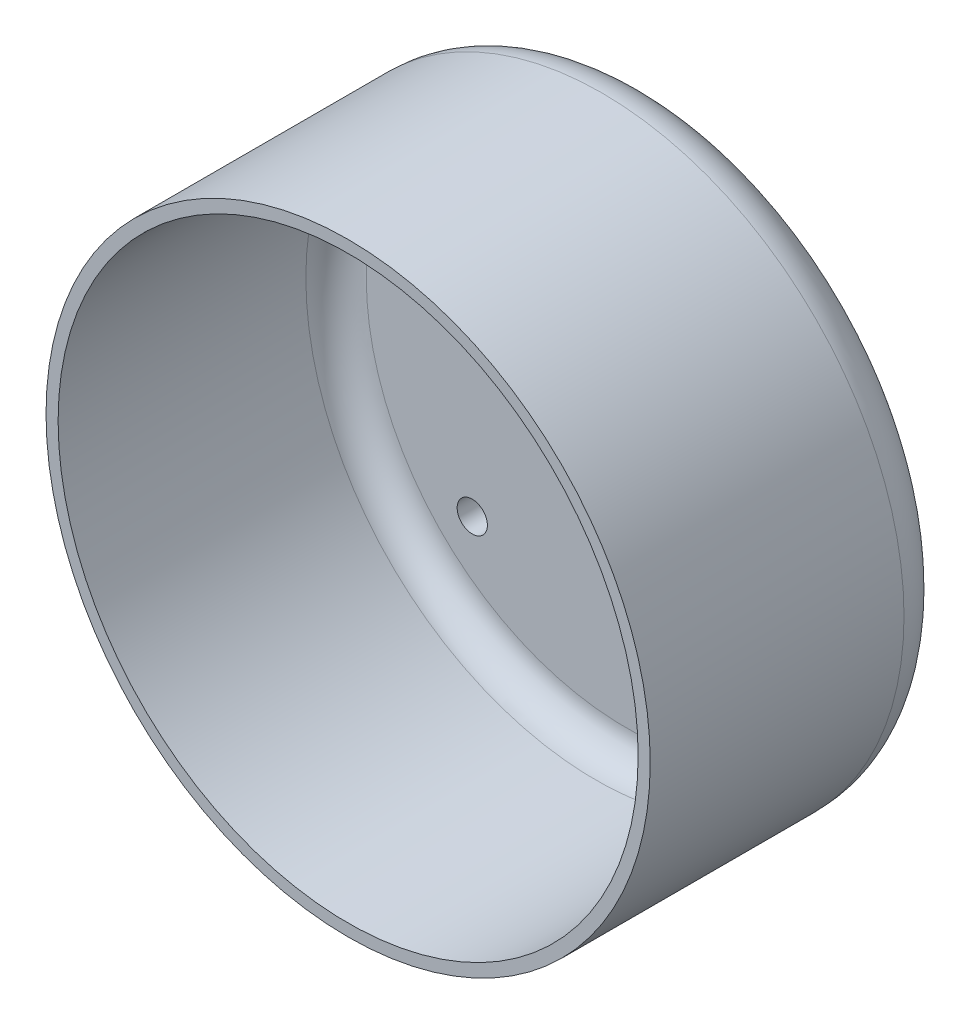
ISO-10303-21;
HEADER;
FILE_DESCRIPTION(('STEP AP214'),'2;1');
FILE_NAME('part.step','',(''),(''),'','','');
FILE_SCHEMA(('AUTOMOTIVE_DESIGN { 1 0 10303 214 1 1 1 1 }'));
ENDSEC;
DATA;
#1=APPLICATION_CONTEXT('core data for automotive mechanical design processes');
#2=APPLICATION_PROTOCOL_DEFINITION('international standard','automotive_design',2000,#1);
#3=PRODUCT_CONTEXT('',#1,'mechanical');
#4=PRODUCT('Part','Part','',(#3));
#5=PRODUCT_RELATED_PRODUCT_CATEGORY('part','',(#4));
#6=PRODUCT_DEFINITION_FORMATION('','',#4);
#7=PRODUCT_DEFINITION_CONTEXT('part definition',#1,'design');
#8=PRODUCT_DEFINITION('design','',#6,#7);
#9=PRODUCT_DEFINITION_SHAPE('','',#8);
#10=(LENGTH_UNIT() NAMED_UNIT(*) SI_UNIT(.MILLI.,.METRE.));
#11=(NAMED_UNIT(*) PLANE_ANGLE_UNIT() SI_UNIT($,.RADIAN.));
#12=(NAMED_UNIT(*) SI_UNIT($,.STERADIAN.) SOLID_ANGLE_UNIT());
#13=UNCERTAINTY_MEASURE_WITH_UNIT(LENGTH_MEASURE(1.E-05),#10,'distance_accuracy_value','');
#14=(GEOMETRIC_REPRESENTATION_CONTEXT(3) GLOBAL_UNCERTAINTY_ASSIGNED_CONTEXT((#13)) GLOBAL_UNIT_ASSIGNED_CONTEXT((#10,
#11,#12)) REPRESENTATION_CONTEXT('',''));
#15=CARTESIAN_POINT('',(0.,0.,0.));
#16=DIRECTION('',(0.,0.,1.));
#17=DIRECTION('',(1.,0.,0.));
#18=AXIS2_PLACEMENT_3D('',#15,#16,#17);
#19=CARTESIAN_POINT('',(0.,0.,0.));
#20=DIRECTION('',(0.,0.,1.));
#21=DIRECTION('',(1.,0.,0.));
#22=AXIS2_PLACEMENT_3D('',#19,#20,#21);
#23=PLANE('',#22);
#24=CARTESIAN_POINT('',(0.,0.,0.));
#25=DIRECTION('',(0.,0.,1.));
#26=DIRECTION('',(1.,0.,0.));
#27=AXIS2_PLACEMENT_3D('',#24,#25,#26);
#28=CIRCLE('',#27,21.);
#29=CARTESIAN_POINT('',(21.,0.,0.));
#30=VERTEX_POINT('',#29);
#31=EDGE_CURVE('E42',#30,#30,#28,.F.);
#32=ORIENTED_EDGE('',*,*,#31,.T.);
#33=EDGE_LOOP('',(#32));
#34=FACE_BOUND('',#33,.T.);
#35=CARTESIAN_POINT('',(-12.727922061358,-12.7279220613577,0.));
#36=DIRECTION('',(0.,0.,-1.));
#37=DIRECTION('',(-1.,0.,0.));
#38=AXIS2_PLACEMENT_3D('',#35,#36,#37);
#39=CIRCLE('',#38,1.24999999999999);
#40=CARTESIAN_POINT('',(-13.977922061358,-12.7279220613577,0.));
#41=VERTEX_POINT('',#40);
#42=EDGE_CURVE('E56',#41,#41,#39,.T.);
#43=ORIENTED_EDGE('',*,*,#42,.F.);
#44=EDGE_LOOP('',(#43));
#45=FACE_BOUND('',#44,.T.);
#46=CARTESIAN_POINT('',(12.7279220613578,-12.7279220613579,0.));
#47=DIRECTION('',(0.,0.,-1.));
#48=DIRECTION('',(-1.,0.,0.));
#49=AXIS2_PLACEMENT_3D('',#46,#47,#48);
#50=CIRCLE('',#49,1.24999999999999);
#51=CARTESIAN_POINT('',(11.4779220613578,-12.7279220613579,0.));
#52=VERTEX_POINT('',#51);
#53=EDGE_CURVE('E55',#52,#52,#50,.T.);
#54=ORIENTED_EDGE('',*,*,#53,.F.);
#55=EDGE_LOOP('',(#54));
#56=FACE_BOUND('',#55,.T.);
#57=CARTESIAN_POINT('',(12.7279220613579,12.7279220613578,0.));
#58=DIRECTION('',(0.,0.,-1.));
#59=DIRECTION('',(-1.,0.,0.));
#60=AXIS2_PLACEMENT_3D('',#57,#58,#59);
#61=CIRCLE('',#60,1.24999999999999);
#62=CARTESIAN_POINT('',(11.4779220613579,12.7279220613578,0.));
#63=VERTEX_POINT('',#62);
#64=EDGE_CURVE('E83',#63,#63,#61,.T.);
#65=ORIENTED_EDGE('',*,*,#64,.F.);
#66=EDGE_LOOP('',(#65));
#67=FACE_BOUND('',#66,.T.);
#68=CARTESIAN_POINT('',(-12.7279220613578,12.7279220613579,0.));
#69=DIRECTION('',(0.,0.,-1.));
#70=DIRECTION('',(-1.,0.,0.));
#71=AXIS2_PLACEMENT_3D('',#68,#69,#70);
#72=CIRCLE('',#71,1.24999999999999);
#73=CARTESIAN_POINT('',(-13.9779220613578,12.7279220613579,0.));
#74=VERTEX_POINT('',#73);
#75=EDGE_CURVE('E77',#74,#74,#72,.T.);
#76=ORIENTED_EDGE('',*,*,#75,.F.);
#77=EDGE_LOOP('',(#76));
#78=FACE_BOUND('',#77,.T.);
#79=CARTESIAN_POINT('',(0.,0.,0.));
#80=DIRECTION('',(0.,0.,1.));
#81=DIRECTION('',(1.,0.,0.));
#82=AXIS2_PLACEMENT_3D('',#79,#80,#81);
#83=CIRCLE('',#82,16.5);
#84=CARTESIAN_POINT('',(16.5,0.,0.));
#85=VERTEX_POINT('',#84);
#86=EDGE_CURVE('E51',#85,#85,#83,.F.);
#87=ORIENTED_EDGE('',*,*,#86,.F.);
#88=EDGE_LOOP('',(#87));
#89=FACE_BOUND('',#88,.T.);
#90=ADVANCED_FACE('F31',(#34,#45,#56,#67,#78,#89),#23,.F.);
#91=CARTESIAN_POINT('',(0.,0.,25.));
#92=DIRECTION('',(0.,0.,-1.));
#93=DIRECTION('',(-1.,0.,0.));
#94=AXIS2_PLACEMENT_3D('',#91,#92,#93);
#95=CYLINDRICAL_SURFACE('',#94,25.);
#96=CARTESIAN_POINT('',(0.,0.,4.));
#97=DIRECTION('',(0.,0.,1.));
#98=DIRECTION('',(1.,0.,0.));
#99=AXIS2_PLACEMENT_3D('',#96,#97,#98);
#100=CIRCLE('',#99,25.);
#101=CARTESIAN_POINT('',(25.,0.,4.));
#102=VERTEX_POINT('',#101);
#103=EDGE_CURVE('E46',#102,#102,#100,.T.);
#104=ORIENTED_EDGE('',*,*,#103,.T.);
#105=EDGE_LOOP('',(#104));
#106=FACE_BOUND('',#105,.T.);
#107=CARTESIAN_POINT('',(0.,0.,25.));
#108=DIRECTION('',(0.,0.,1.));
#109=DIRECTION('',(1.,0.,0.));
#110=AXIS2_PLACEMENT_3D('',#107,#108,#109);
#111=CIRCLE('',#110,25.);
#112=CARTESIAN_POINT('',(25.,0.,25.));
#113=VERTEX_POINT('',#112);
#114=EDGE_CURVE('E59',#113,#113,#111,.T.);
#115=ORIENTED_EDGE('',*,*,#114,.F.);
#116=EDGE_LOOP('',(#115));
#117=FACE_BOUND('',#116,.T.);
#118=ADVANCED_FACE('F123',(#106,#117),#95,.T.);
#119=CARTESIAN_POINT('',(0.,0.,25.));
#120=DIRECTION('',(0.,0.,1.));
#121=DIRECTION('',(1.,0.,0.));
#122=AXIS2_PLACEMENT_3D('',#119,#120,#121);
#123=PLANE('',#122);
#124=CARTESIAN_POINT('',(0.,0.,25.));
#125=DIRECTION('',(0.,0.,1.));
#126=DIRECTION('',(1.,0.,0.));
#127=AXIS2_PLACEMENT_3D('',#124,#125,#126);
#128=CIRCLE('',#127,24.);
#129=CARTESIAN_POINT('',(24.,0.,25.));
#130=VERTEX_POINT('',#129);
#131=EDGE_CURVE('E62',#130,#130,#128,.T.);
#132=ORIENTED_EDGE('',*,*,#131,.F.);
#133=EDGE_LOOP('',(#132));
#134=FACE_BOUND('',#133,.T.);
#135=ORIENTED_EDGE('',*,*,#114,.T.);
#136=EDGE_LOOP('',(#135));
#137=FACE_BOUND('',#136,.T.);
#138=ADVANCED_FACE('F128',(#134,#137),#123,.T.);
#139=CARTESIAN_POINT('',(0.,0.,25.));
#140=DIRECTION('',(0.,0.,-1.));
#141=DIRECTION('',(-1.,0.,0.));
#142=AXIS2_PLACEMENT_3D('',#139,#140,#141);
#143=CYLINDRICAL_SURFACE('',#142,24.);
#144=CARTESIAN_POINT('',(0.,0.,4.5));
#145=DIRECTION('',(0.,0.,1.));
#146=DIRECTION('',(1.,0.,0.));
#147=AXIS2_PLACEMENT_3D('',#144,#145,#146);
#148=CIRCLE('',#147,24.);
#149=CARTESIAN_POINT('',(24.,0.,4.5));
#150=VERTEX_POINT('',#149);
#151=EDGE_CURVE('E10',#150,#150,#148,.F.);
#152=ORIENTED_EDGE('',*,*,#151,.T.);
#153=EDGE_LOOP('',(#152));
#154=FACE_BOUND('',#153,.T.);
#155=ORIENTED_EDGE('',*,*,#131,.T.);
#156=EDGE_LOOP('',(#155));
#157=FACE_BOUND('',#156,.T.);
#158=ADVANCED_FACE('F153',(#154,#157),#143,.F.);
#159=CARTESIAN_POINT('',(0.,0.,2.));
#160=DIRECTION('',(0.,0.,1.));
#161=DIRECTION('',(1.,0.,0.));
#162=AXIS2_PLACEMENT_3D('',#159,#160,#161);
#163=PLANE('',#162);
#164=CARTESIAN_POINT('',(0.,0.,2.));
#165=DIRECTION('',(0.,0.,1.));
#166=DIRECTION('',(1.,0.,0.));
#167=AXIS2_PLACEMENT_3D('',#164,#165,#166);
#168=CIRCLE('',#167,2.5);
#169=CARTESIAN_POINT('',(2.5,0.,2.));
#170=VERTEX_POINT('',#169);
#171=EDGE_CURVE('E93',#170,#170,#168,.T.);
#172=ORIENTED_EDGE('',*,*,#171,.F.);
#173=EDGE_LOOP('',(#172));
#174=FACE_BOUND('',#173,.T.);
#175=CARTESIAN_POINT('',(0.,0.,2.));
#176=DIRECTION('',(0.,0.,1.));
#177=DIRECTION('',(1.,0.,0.));
#178=AXIS2_PLACEMENT_3D('',#175,#176,#177);
#179=CIRCLE('',#178,21.5);
#180=CARTESIAN_POINT('',(21.5,0.,2.));
#181=VERTEX_POINT('',#180);
#182=EDGE_CURVE('E38',#181,#181,#179,.T.);
#183=ORIENTED_EDGE('',*,*,#182,.T.);
#184=EDGE_LOOP('',(#183));
#185=FACE_BOUND('',#184,.T.);
#186=CARTESIAN_POINT('',(-12.727922061358,-12.7279220613577,2.));
#187=DIRECTION('',(0.,0.,1.));
#188=DIRECTION('',(1.,0.,0.));
#189=AXIS2_PLACEMENT_3D('',#186,#187,#188);
#190=CIRCLE('',#189,1.24999999999999);
#191=CARTESIAN_POINT('',(-11.477922061358,-12.7279220613577,2.));
#192=VERTEX_POINT('',#191);
#193=EDGE_CURVE('E52',#192,#192,#190,.T.);
#194=ORIENTED_EDGE('',*,*,#193,.F.);
#195=EDGE_LOOP('',(#194));
#196=FACE_BOUND('',#195,.T.);
#197=CARTESIAN_POINT('',(12.7279220613578,-12.7279220613579,2.));
#198=DIRECTION('',(0.,0.,1.));
#199=DIRECTION('',(1.,0.,0.));
#200=AXIS2_PLACEMENT_3D('',#197,#198,#199);
#201=CIRCLE('',#200,1.24999999999999);
#202=CARTESIAN_POINT('',(13.9779220613578,-12.7279220613579,2.));
#203=VERTEX_POINT('',#202);
#204=EDGE_CURVE('E86',#203,#203,#201,.T.);
#205=ORIENTED_EDGE('',*,*,#204,.F.);
#206=EDGE_LOOP('',(#205));
#207=FACE_BOUND('',#206,.T.);
#208=CARTESIAN_POINT('',(12.7279220613579,12.7279220613578,2.));
#209=DIRECTION('',(0.,0.,1.));
#210=DIRECTION('',(1.,0.,0.));
#211=AXIS2_PLACEMENT_3D('',#208,#209,#210);
#212=CIRCLE('',#211,1.24999999999999);
#213=CARTESIAN_POINT('',(13.9779220613579,12.7279220613578,2.));
#214=VERTEX_POINT('',#213);
#215=EDGE_CURVE('E80',#214,#214,#212,.T.);
#216=ORIENTED_EDGE('',*,*,#215,.F.);
#217=EDGE_LOOP('',(#216));
#218=FACE_BOUND('',#217,.T.);
#219=CARTESIAN_POINT('',(-12.7279220613578,12.7279220613579,2.));
#220=DIRECTION('',(0.,0.,1.));
#221=DIRECTION('',(1.,0.,0.));
#222=AXIS2_PLACEMENT_3D('',#219,#220,#221);
#223=CIRCLE('',#222,1.24999999999999);
#224=CARTESIAN_POINT('',(-11.4779220613578,12.7279220613579,2.));
#225=VERTEX_POINT('',#224);
#226=EDGE_CURVE('E72',#225,#225,#223,.T.);
#227=ORIENTED_EDGE('',*,*,#226,.F.);
#228=EDGE_LOOP('',(#227));
#229=FACE_BOUND('',#228,.T.);
#230=ADVANCED_FACE('F158',(#174,#185,#196,#207,#218,#229),#163,.T.);
#231=CARTESIAN_POINT('',(0.,0.,-1.));
#232=DIRECTION('',(0.,0.,-1.));
#233=DIRECTION('',(-1.,0.,0.));
#234=AXIS2_PLACEMENT_3D('',#231,#232,#233);
#235=PLANE('',#234);
#236=CARTESIAN_POINT('',(0.,0.,-1.));
#237=DIRECTION('',(0.,0.,-1.));
#238=DIRECTION('',(-1.,0.,0.));
#239=AXIS2_PLACEMENT_3D('',#236,#237,#238);
#240=CIRCLE('',#239,16.5);
#241=CARTESIAN_POINT('',(-16.5,0.,-1.));
#242=VERTEX_POINT('',#241);
#243=EDGE_CURVE('E65',#242,#242,#240,.T.);
#244=ORIENTED_EDGE('',*,*,#243,.T.);
#245=EDGE_LOOP('',(#244));
#246=FACE_BOUND('',#245,.T.);
#247=CARTESIAN_POINT('',(0.,0.,-1.));
#248=DIRECTION('',(0.,0.,-1.));
#249=DIRECTION('',(-1.,0.,0.));
#250=AXIS2_PLACEMENT_3D('',#247,#248,#249);
#251=CIRCLE('',#250,15.5);
#252=CARTESIAN_POINT('',(-15.5,0.,-1.));
#253=VERTEX_POINT('',#252);
#254=EDGE_CURVE('E68',#253,#253,#251,.T.);
#255=ORIENTED_EDGE('',*,*,#254,.F.);
#256=EDGE_LOOP('',(#255));
#257=FACE_BOUND('',#256,.T.);
#258=ADVANCED_FACE('F117',(#246,#257),#235,.T.);
#259=CARTESIAN_POINT('',(0.,0.,-1.));
#260=DIRECTION('',(0.,0.,1.));
#261=DIRECTION('',(1.,0.,0.));
#262=AXIS2_PLACEMENT_3D('',#259,#260,#261);
#263=CYLINDRICAL_SURFACE('',#262,16.5);
#264=ORIENTED_EDGE('',*,*,#243,.F.);
#265=EDGE_LOOP('',(#264));
#266=FACE_BOUND('',#265,.T.);
#267=ORIENTED_EDGE('',*,*,#86,.T.);
#268=EDGE_LOOP('',(#267));
#269=FACE_BOUND('',#268,.T.);
#270=ADVANCED_FACE('F111',(#266,#269),#263,.T.);
#271=CARTESIAN_POINT('',(0.,0.,-1.));
#272=DIRECTION('',(0.,0.,1.));
#273=DIRECTION('',(1.,0.,0.));
#274=AXIS2_PLACEMENT_3D('',#271,#272,#273);
#275=CYLINDRICAL_SURFACE('',#274,15.5);
#276=ORIENTED_EDGE('',*,*,#254,.T.);
#277=EDGE_LOOP('',(#276));
#278=FACE_BOUND('',#277,.T.);
#279=CARTESIAN_POINT('',(0.,0.,0.));
#280=DIRECTION('',(0.,0.,-1.));
#281=DIRECTION('',(-1.,0.,0.));
#282=AXIS2_PLACEMENT_3D('',#279,#280,#281);
#283=CIRCLE('',#282,15.5);
#284=CARTESIAN_POINT('',(-15.5,0.,0.));
#285=VERTEX_POINT('',#284);
#286=EDGE_CURVE('E69',#285,#285,#283,.T.);
#287=ORIENTED_EDGE('',*,*,#286,.F.);
#288=EDGE_LOOP('',(#287));
#289=FACE_BOUND('',#288,.T.);
#290=ADVANCED_FACE('F106',(#278,#289),#275,.F.);
#291=CARTESIAN_POINT('',(0.,0.,0.));
#292=DIRECTION('',(0.,0.,-1.));
#293=DIRECTION('',(-1.,0.,0.));
#294=AXIS2_PLACEMENT_3D('',#291,#292,#293);
#295=CIRCLE('',#294,2.5);
#296=CARTESIAN_POINT('',(-2.5,0.,0.));
#297=VERTEX_POINT('',#296);
#298=EDGE_CURVE('E96',#297,#297,#295,.T.);
#299=ORIENTED_EDGE('',*,*,#298,.F.);
#300=EDGE_LOOP('',(#299));
#301=FACE_BOUND('',#300,.T.);
#302=ORIENTED_EDGE('',*,*,#286,.T.);
#303=EDGE_LOOP('',(#302));
#304=FACE_BOUND('',#303,.T.);
#305=ADVANCED_FACE('F102',(#301,#304),#23,.F.);
#306=CARTESIAN_POINT('',(-12.7279220613578,12.7279220613579,0.));
#307=DIRECTION('',(0.,0.,-1.));
#308=DIRECTION('',(-1.,0.,0.));
#309=AXIS2_PLACEMENT_3D('',#306,#307,#308);
#310=CYLINDRICAL_SURFACE('',#309,1.24999999999999);
#311=ORIENTED_EDGE('',*,*,#226,.T.);
#312=EDGE_LOOP('',(#311));
#313=FACE_BOUND('',#312,.T.);
#314=ORIENTED_EDGE('',*,*,#75,.T.);
#315=EDGE_LOOP('',(#314));
#316=FACE_BOUND('',#315,.T.);
#317=ADVANCED_FACE('F105',(#313,#316),#310,.F.);
#318=CARTESIAN_POINT('',(12.7279220613579,12.7279220613578,0.));
#319=DIRECTION('',(0.,0.,-1.));
#320=DIRECTION('',(-1.,0.,0.));
#321=AXIS2_PLACEMENT_3D('',#318,#319,#320);
#322=CYLINDRICAL_SURFACE('',#321,1.24999999999999);
#323=ORIENTED_EDGE('',*,*,#215,.T.);
#324=EDGE_LOOP('',(#323));
#325=FACE_BOUND('',#324,.T.);
#326=ORIENTED_EDGE('',*,*,#64,.T.);
#327=EDGE_LOOP('',(#326));
#328=FACE_BOUND('',#327,.T.);
#329=ADVANCED_FACE('F195',(#325,#328),#322,.F.);
#330=CARTESIAN_POINT('',(12.7279220613578,-12.7279220613579,0.));
#331=DIRECTION('',(0.,0.,-1.));
#332=DIRECTION('',(-1.,0.,0.));
#333=AXIS2_PLACEMENT_3D('',#330,#331,#332);
#334=CYLINDRICAL_SURFACE('',#333,1.24999999999999);
#335=ORIENTED_EDGE('',*,*,#204,.T.);
#336=EDGE_LOOP('',(#335));
#337=FACE_BOUND('',#336,.T.);
#338=ORIENTED_EDGE('',*,*,#53,.T.);
#339=EDGE_LOOP('',(#338));
#340=FACE_BOUND('',#339,.T.);
#341=ADVANCED_FACE('F143',(#337,#340),#334,.F.);
#342=CARTESIAN_POINT('',(-12.727922061358,-12.7279220613577,0.));
#343=DIRECTION('',(0.,0.,-1.));
#344=DIRECTION('',(-1.,0.,0.));
#345=AXIS2_PLACEMENT_3D('',#342,#343,#344);
#346=CYLINDRICAL_SURFACE('',#345,1.24999999999999);
#347=ORIENTED_EDGE('',*,*,#193,.T.);
#348=EDGE_LOOP('',(#347));
#349=FACE_BOUND('',#348,.T.);
#350=ORIENTED_EDGE('',*,*,#42,.T.);
#351=EDGE_LOOP('',(#350));
#352=FACE_BOUND('',#351,.T.);
#353=ADVANCED_FACE('F136',(#349,#352),#346,.F.);
#354=CARTESIAN_POINT('',(0.,0.,4.));
#355=DIRECTION('',(0.,0.,1.));
#356=DIRECTION('',(1.,0.,0.));
#357=AXIS2_PLACEMENT_3D('',#354,#355,#356);
#358=TOROIDAL_SURFACE('',#357,21.,4.);
#359=ORIENTED_EDGE('',*,*,#31,.F.);
#360=EDGE_LOOP('',(#359));
#361=FACE_BOUND('',#360,.T.);
#362=ORIENTED_EDGE('',*,*,#103,.F.);
#363=EDGE_LOOP('',(#362));
#364=FACE_BOUND('',#363,.T.);
#365=ADVANCED_FACE('F134',(#361,#364),#358,.T.);
#366=CARTESIAN_POINT('',(0.,0.,4.5));
#367=DIRECTION('',(0.,0.,1.));
#368=DIRECTION('',(1.,0.,0.));
#369=AXIS2_PLACEMENT_3D('',#366,#367,#368);
#370=TOROIDAL_SURFACE('',#369,21.5,2.5);
#371=ORIENTED_EDGE('',*,*,#151,.F.);
#372=EDGE_LOOP('',(#371));
#373=FACE_BOUND('',#372,.T.);
#374=ORIENTED_EDGE('',*,*,#182,.F.);
#375=EDGE_LOOP('',(#374));
#376=FACE_BOUND('',#375,.T.);
#377=ADVANCED_FACE('F33',(#373,#376),#370,.F.);
#378=CARTESIAN_POINT('',(0.,0.,21.));
#379=DIRECTION('',(0.,0.,-1.));
#380=DIRECTION('',(-1.,0.,0.));
#381=AXIS2_PLACEMENT_3D('',#378,#379,#380);
#382=CYLINDRICAL_SURFACE('',#381,2.5);
#383=ORIENTED_EDGE('',*,*,#171,.T.);
#384=EDGE_LOOP('',(#383));
#385=FACE_BOUND('',#384,.T.);
#386=ORIENTED_EDGE('',*,*,#298,.T.);
#387=EDGE_LOOP('',(#386));
#388=FACE_BOUND('',#387,.T.);
#389=ADVANCED_FACE('F100',(#385,#388),#382,.F.);
#390=CLOSED_SHELL('',(#90,#118,#138,#158,#230,#258,#270,#290,#305,#317,#329,#341,#353,#365,#377,#389));
#391=MANIFOLD_SOLID_BREP('B2',#390);
#392=ADVANCED_BREP_SHAPE_REPRESENTATION('',(#18,#391),#14);
#393=SHAPE_DEFINITION_REPRESENTATION(#9,#392);
ENDSEC;
END-ISO-10303-21;
